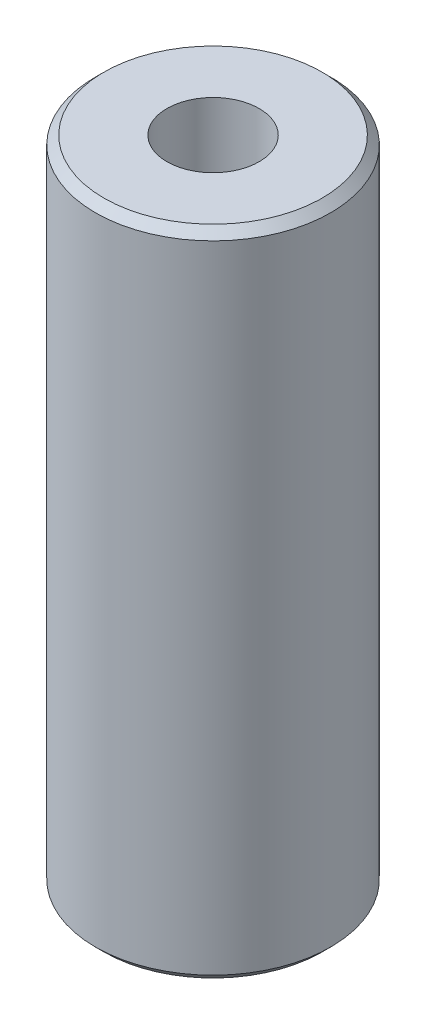
ISO-10303-21;
HEADER;
FILE_DESCRIPTION(('STEP AP214'),'2;1');
FILE_NAME('part.step','',(''),(''),'','','');
FILE_SCHEMA(('AUTOMOTIVE_DESIGN { 1 0 10303 214 1 1 1 1 }'));
ENDSEC;
DATA;
#1=APPLICATION_CONTEXT('core data for automotive mechanical design processes');
#2=APPLICATION_PROTOCOL_DEFINITION('international standard','automotive_design',2000,#1);
#3=PRODUCT_CONTEXT('',#1,'mechanical');
#4=PRODUCT('Part','Part','',(#3));
#5=PRODUCT_RELATED_PRODUCT_CATEGORY('part','',(#4));
#6=PRODUCT_DEFINITION_FORMATION('','',#4);
#7=PRODUCT_DEFINITION_CONTEXT('part definition',#1,'design');
#8=PRODUCT_DEFINITION('design','',#6,#7);
#9=PRODUCT_DEFINITION_SHAPE('','',#8);
#10=(LENGTH_UNIT() NAMED_UNIT(*) SI_UNIT(.MILLI.,.METRE.));
#11=(NAMED_UNIT(*) PLANE_ANGLE_UNIT() SI_UNIT($,.RADIAN.));
#12=(NAMED_UNIT(*) SI_UNIT($,.STERADIAN.) SOLID_ANGLE_UNIT());
#13=UNCERTAINTY_MEASURE_WITH_UNIT(LENGTH_MEASURE(1.E-05),#10,'distance_accuracy_value','');
#14=(GEOMETRIC_REPRESENTATION_CONTEXT(3) GLOBAL_UNCERTAINTY_ASSIGNED_CONTEXT((#13)) GLOBAL_UNIT_ASSIGNED_CONTEXT((#10,
#11,#12)) REPRESENTATION_CONTEXT('',''));
#15=CARTESIAN_POINT('',(0.,0.,0.));
#16=DIRECTION('',(0.,0.,1.));
#17=DIRECTION('',(1.,0.,0.));
#18=AXIS2_PLACEMENT_3D('',#15,#16,#17);
#19=CARTESIAN_POINT('',(0.,208.158488537294,0.));
#20=DIRECTION('',(0.,-1.,0.));
#21=DIRECTION('',(0.,0.,-1.));
#22=AXIS2_PLACEMENT_3D('',#19,#20,#21);
#23=CYLINDRICAL_SURFACE('',#22,37.5);
#24=CARTESIAN_POINT('',(0.,205.458391679337,0.));
#25=DIRECTION('',(0.,1.,0.));
#26=DIRECTION('',(0.,0.,1.));
#27=AXIS2_PLACEMENT_3D('',#24,#25,#26);
#28=CIRCLE('',#27,37.5);
#29=CARTESIAN_POINT('',(0.,205.458391679337,37.5));
#30=VERTEX_POINT('',#29);
#31=EDGE_CURVE('E50',#30,#30,#28,.F.);
#32=ORIENTED_EDGE('',*,*,#31,.T.);
#33=EDGE_LOOP('',(#32));
#34=FACE_BOUND('',#33,.T.);
#35=CARTESIAN_POINT('',(0.,2.70009685795697,0.));
#36=DIRECTION('',(0.,1.,0.));
#37=DIRECTION('',(0.,0.,1.));
#38=AXIS2_PLACEMENT_3D('',#35,#36,#37);
#39=CIRCLE('',#38,37.5);
#40=CARTESIAN_POINT('',(0.,2.70009685795697,37.5));
#41=VERTEX_POINT('',#40);
#42=EDGE_CURVE('E51',#41,#41,#39,.T.);
#43=ORIENTED_EDGE('',*,*,#42,.T.);
#44=EDGE_LOOP('',(#43));
#45=FACE_BOUND('',#44,.T.);
#46=ADVANCED_FACE('F39',(#34,#45),#23,.T.);
#47=CARTESIAN_POINT('',(0.,208.158488537294,0.));
#48=DIRECTION('',(0.,1.,0.));
#49=DIRECTION('',(0.,0.,1.));
#50=AXIS2_PLACEMENT_3D('',#47,#48,#49);
#51=PLANE('',#50);
#52=CARTESIAN_POINT('',(0.,208.158488537294,0.));
#53=DIRECTION('',(0.,1.,0.));
#54=DIRECTION('',(0.,0.,1.));
#55=AXIS2_PLACEMENT_3D('',#52,#53,#54);
#56=CIRCLE('',#55,34.799903142043);
#57=CARTESIAN_POINT('',(0.,208.158488537294,34.799903142043));
#58=VERTEX_POINT('',#57);
#59=EDGE_CURVE('E54',#58,#58,#56,.T.);
#60=ORIENTED_EDGE('',*,*,#59,.T.);
#61=EDGE_LOOP('',(#60));
#62=FACE_BOUND('',#61,.T.);
#63=CARTESIAN_POINT('',(0.,208.158488537294,0.));
#64=DIRECTION('',(0.,1.,0.));
#65=DIRECTION('',(0.,0.,1.));
#66=AXIS2_PLACEMENT_3D('',#63,#64,#65);
#67=CIRCLE('',#66,14.705731175908);
#68=CARTESIAN_POINT('',(0.,208.158488537294,14.705731175908));
#69=VERTEX_POINT('',#68);
#70=EDGE_CURVE('E58',#69,#69,#67,.T.);
#71=ORIENTED_EDGE('',*,*,#70,.F.);
#72=EDGE_LOOP('',(#71));
#73=FACE_BOUND('',#72,.T.);
#74=ADVANCED_FACE('F69',(#62,#73),#51,.T.);
#75=CARTESIAN_POINT('',(0.,0.,0.));
#76=DIRECTION('',(0.,1.,0.));
#77=DIRECTION('',(0.,0.,1.));
#78=AXIS2_PLACEMENT_3D('',#75,#76,#77);
#79=PLANE('',#78);
#80=CARTESIAN_POINT('',(0.,0.,0.));
#81=DIRECTION('',(0.,1.,0.));
#82=DIRECTION('',(0.,0.,1.));
#83=AXIS2_PLACEMENT_3D('',#80,#81,#82);
#84=CIRCLE('',#83,34.799903142043);
#85=CARTESIAN_POINT('',(0.,0.,34.799903142043));
#86=VERTEX_POINT('',#85);
#87=EDGE_CURVE('E10',#86,#86,#84,.F.);
#88=ORIENTED_EDGE('',*,*,#87,.T.);
#89=EDGE_LOOP('',(#88));
#90=FACE_BOUND('',#89,.T.);
#91=CARTESIAN_POINT('',(0.,0.,0.));
#92=DIRECTION('',(0.,1.,0.));
#93=DIRECTION('',(0.,0.,1.));
#94=AXIS2_PLACEMENT_3D('',#91,#92,#93);
#95=CIRCLE('',#94,14.705731175908);
#96=CARTESIAN_POINT('',(0.,0.,14.705731175908));
#97=VERTEX_POINT('',#96);
#98=EDGE_CURVE('E63',#97,#97,#95,.T.);
#99=ORIENTED_EDGE('',*,*,#98,.T.);
#100=EDGE_LOOP('',(#99));
#101=FACE_BOUND('',#100,.T.);
#102=ADVANCED_FACE('F75',(#90,#101),#79,.F.);
#103=CARTESIAN_POINT('',(0.,208.158488537294,0.));
#104=DIRECTION('',(0.,-1.,0.));
#105=DIRECTION('',(0.,0.,-1.));
#106=AXIS2_PLACEMENT_3D('',#103,#104,#105);
#107=CYLINDRICAL_SURFACE('',#106,14.705731175908);
#108=ORIENTED_EDGE('',*,*,#70,.T.);
#109=EDGE_LOOP('',(#108));
#110=FACE_BOUND('',#109,.T.);
#111=ORIENTED_EDGE('',*,*,#98,.F.);
#112=EDGE_LOOP('',(#111));
#113=FACE_BOUND('',#112,.T.);
#114=ADVANCED_FACE('F70',(#110,#113),#107,.F.);
#115=CARTESIAN_POINT('',(0.,208.158488537294,0.));
#116=DIRECTION('',(0.,-1.,0.));
#117=DIRECTION('',(0.,0.,-1.));
#118=AXIS2_PLACEMENT_3D('',#115,#116,#117);
#119=CONICAL_SURFACE('',#118,34.799903142043,0.785398163397448);
#120=ORIENTED_EDGE('',*,*,#31,.F.);
#121=EDGE_LOOP('',(#120));
#122=FACE_BOUND('',#121,.T.);
#123=ORIENTED_EDGE('',*,*,#59,.F.);
#124=EDGE_LOOP('',(#123));
#125=FACE_BOUND('',#124,.T.);
#126=ADVANCED_FACE('F81',(#122,#125),#119,.T.);
#127=CARTESIAN_POINT('',(0.,2.70009685795697,0.));
#128=DIRECTION('',(0.,1.,0.));
#129=DIRECTION('',(0.,0.,1.));
#130=AXIS2_PLACEMENT_3D('',#127,#128,#129);
#131=CONICAL_SURFACE('',#130,37.5,0.785398163397448);
#132=ORIENTED_EDGE('',*,*,#87,.F.);
#133=EDGE_LOOP('',(#132));
#134=FACE_BOUND('',#133,.T.);
#135=ORIENTED_EDGE('',*,*,#42,.F.);
#136=EDGE_LOOP('',(#135));
#137=FACE_BOUND('',#136,.T.);
#138=ADVANCED_FACE('F45',(#134,#137),#131,.T.);
#139=CLOSED_SHELL('',(#46,#74,#102,#114,#126,#138));
#140=MANIFOLD_SOLID_BREP('B2',#139);
#141=ADVANCED_BREP_SHAPE_REPRESENTATION('',(#18,#140),#14);
#142=SHAPE_DEFINITION_REPRESENTATION(#9,#141);
ENDSEC;
END-ISO-10303-21;
